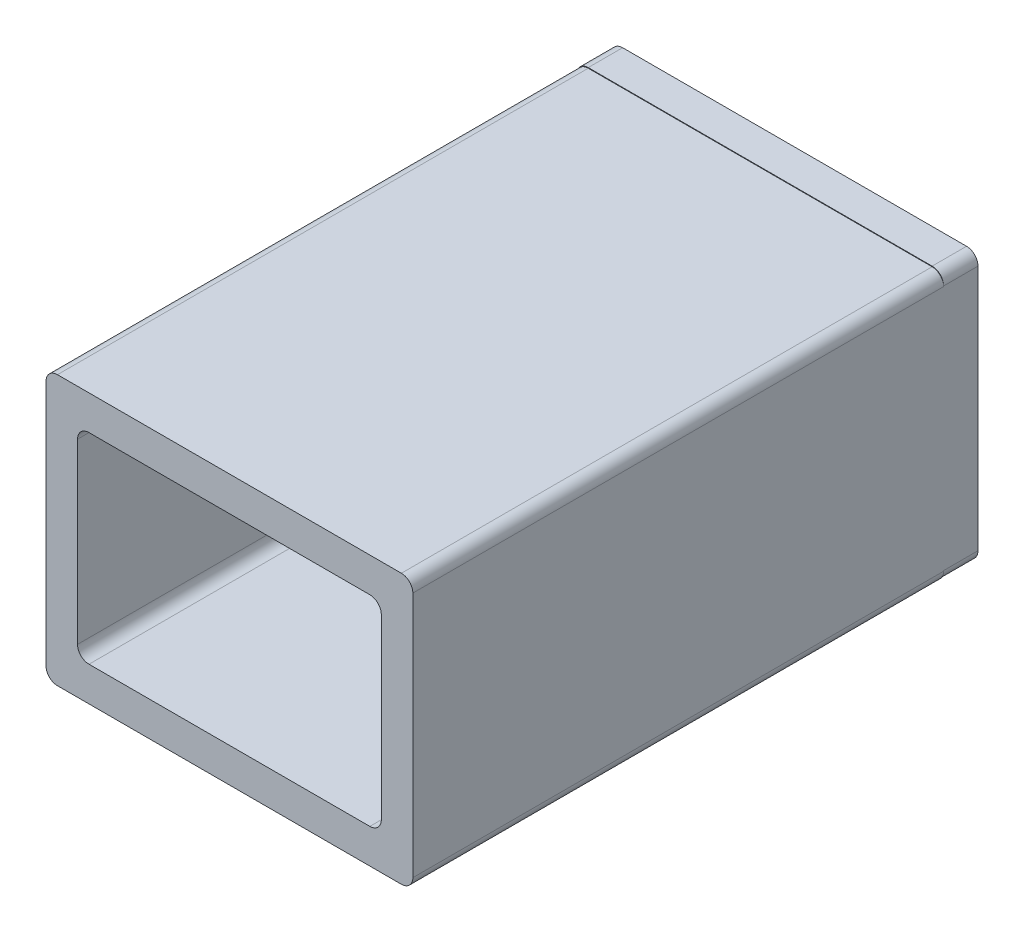
ISO-10303-21;
HEADER;
FILE_DESCRIPTION(('STEP AP214'),'2;1');
FILE_NAME('part.step','',(''),(''),'','','');
FILE_SCHEMA(('AUTOMOTIVE_DESIGN { 1 0 10303 214 1 1 1 1 }'));
ENDSEC;
DATA;
#1=APPLICATION_CONTEXT('core data for automotive mechanical design processes');
#2=APPLICATION_PROTOCOL_DEFINITION('international standard','automotive_design',2000,#1);
#3=PRODUCT_CONTEXT('',#1,'mechanical');
#4=PRODUCT('Part','Part','',(#3));
#5=PRODUCT_RELATED_PRODUCT_CATEGORY('part','',(#4));
#6=PRODUCT_DEFINITION_FORMATION('','',#4);
#7=PRODUCT_DEFINITION_CONTEXT('part definition',#1,'design');
#8=PRODUCT_DEFINITION('design','',#6,#7);
#9=PRODUCT_DEFINITION_SHAPE('','',#8);
#10=(LENGTH_UNIT() NAMED_UNIT(*) SI_UNIT(.MILLI.,.METRE.));
#11=(NAMED_UNIT(*) PLANE_ANGLE_UNIT() SI_UNIT($,.RADIAN.));
#12=(NAMED_UNIT(*) SI_UNIT($,.STERADIAN.) SOLID_ANGLE_UNIT());
#13=UNCERTAINTY_MEASURE_WITH_UNIT(LENGTH_MEASURE(1.E-05),#10,'distance_accuracy_value','');
#14=(GEOMETRIC_REPRESENTATION_CONTEXT(3) GLOBAL_UNCERTAINTY_ASSIGNED_CONTEXT((#13)) GLOBAL_UNIT_ASSIGNED_CONTEXT((#10,
#11,#12)) REPRESENTATION_CONTEXT('',''));
#15=CARTESIAN_POINT('',(0.,0.,0.));
#16=DIRECTION('',(0.,0.,1.));
#17=DIRECTION('',(1.,0.,0.));
#18=AXIS2_PLACEMENT_3D('',#15,#16,#17);
#19=CARTESIAN_POINT('',(15.,-10.75,46.3));
#20=DIRECTION('',(0.,0.,1.));
#21=DIRECTION('',(1.,0.,0.));
#22=AXIS2_PLACEMENT_3D('',#19,#20,#21);
#23=PLANE('',#22);
#24=CARTESIAN_POINT('',(15.,-10.75,46.3));
#25=DIRECTION('',(0.,0.,1.));
#26=DIRECTION('',(1.,0.,0.));
#27=AXIS2_PLACEMENT_3D('',#24,#25,#26);
#28=CIRCLE('',#27,0.999999999999999);
#29=CARTESIAN_POINT('',(15.,-11.75,46.3));
#30=VERTEX_POINT('',#29);
#31=CARTESIAN_POINT('',(16.,-10.75,46.3));
#32=VERTEX_POINT('',#31);
#33=EDGE_CURVE('E322',#30,#32,#28,.T.);
#34=ORIENTED_EDGE('',*,*,#33,.T.);
#35=DIRECTION('',(0.,1.,0.));
#36=VECTOR('',#35,1.);
#37=CARTESIAN_POINT('',(16.,10.75,46.3));
#38=LINE('',#37,#36);
#39=CARTESIAN_POINT('',(16.,10.75,46.3));
#40=VERTEX_POINT('',#39);
#41=EDGE_CURVE('E325',#32,#40,#38,.T.);
#42=ORIENTED_EDGE('',*,*,#41,.T.);
#43=CARTESIAN_POINT('',(15.,10.75,46.3));
#44=DIRECTION('',(0.,0.,1.));
#45=DIRECTION('',(-1.,0.,0.));
#46=AXIS2_PLACEMENT_3D('',#43,#44,#45);
#47=CIRCLE('',#46,1.);
#48=CARTESIAN_POINT('',(15.,11.75,46.3));
#49=VERTEX_POINT('',#48);
#50=EDGE_CURVE('E328',#40,#49,#47,.T.);
#51=ORIENTED_EDGE('',*,*,#50,.T.);
#52=DIRECTION('',(-1.,0.,0.));
#53=VECTOR('',#52,1.);
#54=CARTESIAN_POINT('',(-15.,11.75,46.3));
#55=LINE('',#54,#53);
#56=CARTESIAN_POINT('',(-15.,11.75,46.3));
#57=VERTEX_POINT('',#56);
#58=EDGE_CURVE('E330',#49,#57,#55,.T.);
#59=ORIENTED_EDGE('',*,*,#58,.T.);
#60=CARTESIAN_POINT('',(-15.,10.75,46.3));
#61=DIRECTION('',(0.,0.,1.));
#62=DIRECTION('',(1.,0.,0.));
#63=AXIS2_PLACEMENT_3D('',#60,#61,#62);
#64=CIRCLE('',#63,0.999999999999999);
#65=CARTESIAN_POINT('',(-16.,10.75,46.3));
#66=VERTEX_POINT('',#65);
#67=EDGE_CURVE('E332',#57,#66,#64,.T.);
#68=ORIENTED_EDGE('',*,*,#67,.T.);
#69=DIRECTION('',(0.,-1.,0.));
#70=VECTOR('',#69,1.);
#71=CARTESIAN_POINT('',(-16.,10.75,46.3));
#72=LINE('',#71,#70);
#73=CARTESIAN_POINT('',(-16.,-10.75,46.3));
#74=VERTEX_POINT('',#73);
#75=EDGE_CURVE('E334',#66,#74,#72,.T.);
#76=ORIENTED_EDGE('',*,*,#75,.T.);
#77=CARTESIAN_POINT('',(-15.,-10.75,46.3));
#78=DIRECTION('',(0.,0.,1.));
#79=DIRECTION('',(1.,0.,0.));
#80=AXIS2_PLACEMENT_3D('',#77,#78,#79);
#81=CIRCLE('',#80,1.);
#82=CARTESIAN_POINT('',(-15.,-11.75,46.3));
#83=VERTEX_POINT('',#82);
#84=EDGE_CURVE('E336',#74,#83,#81,.T.);
#85=ORIENTED_EDGE('',*,*,#84,.T.);
#86=DIRECTION('',(1.,0.,0.));
#87=VECTOR('',#86,1.);
#88=CARTESIAN_POINT('',(-15.,-11.75,46.3));
#89=LINE('',#88,#87);
#90=EDGE_CURVE('E338',#83,#30,#89,.T.);
#91=ORIENTED_EDGE('',*,*,#90,.T.);
#92=EDGE_LOOP('',(#34,#42,#51,#59,#68,#76,#85,#91));
#93=FACE_BOUND('',#92,.T.);
#94=DIRECTION('',(0.,-1.,0.));
#95=VECTOR('',#94,1.);
#96=CARTESIAN_POINT('',(-13.25,7.75,46.3));
#97=LINE('',#96,#95);
#98=CARTESIAN_POINT('',(-13.25,7.75,46.3));
#99=VERTEX_POINT('',#98);
#100=CARTESIAN_POINT('',(-13.25,-7.75,46.3));
#101=VERTEX_POINT('',#100);
#102=EDGE_CURVE('E268',#99,#101,#97,.T.);
#103=ORIENTED_EDGE('',*,*,#102,.F.);
#104=CARTESIAN_POINT('',(-12.25,7.75,46.3));
#105=DIRECTION('',(0.,0.,1.));
#106=DIRECTION('',(1.,0.,0.));
#107=AXIS2_PLACEMENT_3D('',#104,#105,#106);
#108=CIRCLE('',#107,1.);
#109=CARTESIAN_POINT('',(-12.25,8.75,46.3));
#110=VERTEX_POINT('',#109);
#111=EDGE_CURVE('E266',#110,#99,#108,.T.);
#112=ORIENTED_EDGE('',*,*,#111,.F.);
#113=DIRECTION('',(-1.,0.,0.));
#114=VECTOR('',#113,1.);
#115=CARTESIAN_POINT('',(-12.25,8.75,46.3));
#116=LINE('',#115,#114);
#117=CARTESIAN_POINT('',(12.25,8.75,46.3));
#118=VERTEX_POINT('',#117);
#119=EDGE_CURVE('E281',#118,#110,#116,.T.);
#120=ORIENTED_EDGE('',*,*,#119,.F.);
#121=CARTESIAN_POINT('',(12.25,7.75,46.3));
#122=DIRECTION('',(0.,0.,1.));
#123=DIRECTION('',(-1.,0.,0.));
#124=AXIS2_PLACEMENT_3D('',#121,#122,#123);
#125=CIRCLE('',#124,0.999999999999999);
#126=CARTESIAN_POINT('',(13.25,7.75,46.3));
#127=VERTEX_POINT('',#126);
#128=EDGE_CURVE('E279',#127,#118,#125,.T.);
#129=ORIENTED_EDGE('',*,*,#128,.F.);
#130=DIRECTION('',(0.,1.,0.));
#131=VECTOR('',#130,1.);
#132=CARTESIAN_POINT('',(13.25,7.75,46.3));
#133=LINE('',#132,#131);
#134=CARTESIAN_POINT('',(13.25,-7.75,46.3));
#135=VERTEX_POINT('',#134);
#136=EDGE_CURVE('E277',#135,#127,#133,.T.);
#137=ORIENTED_EDGE('',*,*,#136,.F.);
#138=CARTESIAN_POINT('',(12.25,-7.75,46.3));
#139=DIRECTION('',(0.,0.,1.));
#140=DIRECTION('',(1.,0.,0.));
#141=AXIS2_PLACEMENT_3D('',#138,#139,#140);
#142=CIRCLE('',#141,0.999999999999999);
#143=CARTESIAN_POINT('',(12.25,-8.75,46.3));
#144=VERTEX_POINT('',#143);
#145=EDGE_CURVE('E275',#144,#135,#142,.T.);
#146=ORIENTED_EDGE('',*,*,#145,.F.);
#147=DIRECTION('',(1.,0.,0.));
#148=VECTOR('',#147,1.);
#149=CARTESIAN_POINT('',(-12.25,-8.75,46.3));
#150=LINE('',#149,#148);
#151=CARTESIAN_POINT('',(-12.25,-8.75,46.3));
#152=VERTEX_POINT('',#151);
#153=EDGE_CURVE('E273',#152,#144,#150,.T.);
#154=ORIENTED_EDGE('',*,*,#153,.F.);
#155=CARTESIAN_POINT('',(-12.25,-7.75,46.3));
#156=DIRECTION('',(0.,0.,1.));
#157=DIRECTION('',(1.,0.,0.));
#158=AXIS2_PLACEMENT_3D('',#155,#156,#157);
#159=CIRCLE('',#158,1.);
#160=EDGE_CURVE('E271',#101,#152,#159,.T.);
#161=ORIENTED_EDGE('',*,*,#160,.F.);
#162=EDGE_LOOP('',(#103,#112,#120,#129,#137,#146,#154,#161));
#163=FACE_BOUND('',#162,.T.);
#164=ADVANCED_FACE('F33',(#93,#163),#23,.T.);
#165=CARTESIAN_POINT('',(15.,-10.75,0.));
#166=DIRECTION('',(0.,0.,1.));
#167=DIRECTION('',(1.,0.,0.));
#168=AXIS2_PLACEMENT_3D('',#165,#166,#167);
#169=PLANE('',#168);
#170=DIRECTION('',(1.,0.,0.));
#171=VECTOR('',#170,1.);
#172=CARTESIAN_POINT('',(-15.,-11.7,0.));
#173=LINE('',#172,#171);
#174=CARTESIAN_POINT('',(-15.,-11.7,0.));
#175=VERTEX_POINT('',#174);
#176=CARTESIAN_POINT('',(15.,-11.7,0.));
#177=VERTEX_POINT('',#176);
#178=EDGE_CURVE('E217',#175,#177,#173,.T.);
#179=ORIENTED_EDGE('',*,*,#178,.T.);
#180=CARTESIAN_POINT('',(15.,-10.7,0.));
#181=DIRECTION('',(0.,0.,1.));
#182=DIRECTION('',(1.,0.,0.));
#183=AXIS2_PLACEMENT_3D('',#180,#181,#182);
#184=CIRCLE('',#183,0.999999999999999);
#185=CARTESIAN_POINT('',(16.,-10.7,0.));
#186=VERTEX_POINT('',#185);
#187=EDGE_CURVE('E48',#177,#186,#184,.T.);
#188=ORIENTED_EDGE('',*,*,#187,.T.);
#189=DIRECTION('',(0.,1.,0.));
#190=VECTOR('',#189,1.);
#191=CARTESIAN_POINT('',(16.,10.75,0.));
#192=LINE('',#191,#190);
#193=CARTESIAN_POINT('',(16.,-10.75,0.));
#194=VERTEX_POINT('',#193);
#195=EDGE_CURVE('E199',#194,#186,#192,.T.);
#196=ORIENTED_EDGE('',*,*,#195,.F.);
#197=CARTESIAN_POINT('',(15.,-10.75,0.));
#198=DIRECTION('',(0.,0.,1.));
#199=DIRECTION('',(1.,0.,0.));
#200=AXIS2_PLACEMENT_3D('',#197,#198,#199);
#201=CIRCLE('',#200,0.999999999999999);
#202=CARTESIAN_POINT('',(15.,-11.75,0.));
#203=VERTEX_POINT('',#202);
#204=EDGE_CURVE('E321',#203,#194,#201,.T.);
#205=ORIENTED_EDGE('',*,*,#204,.F.);
#206=DIRECTION('',(1.,0.,0.));
#207=VECTOR('',#206,1.);
#208=CARTESIAN_POINT('',(-15.,-11.75,0.));
#209=LINE('',#208,#207);
#210=CARTESIAN_POINT('',(-15.,-11.75,0.));
#211=VERTEX_POINT('',#210);
#212=EDGE_CURVE('E326',#211,#203,#209,.T.);
#213=ORIENTED_EDGE('',*,*,#212,.F.);
#214=CARTESIAN_POINT('',(-15.,-10.75,0.));
#215=DIRECTION('',(0.,0.,1.));
#216=DIRECTION('',(1.,0.,0.));
#217=AXIS2_PLACEMENT_3D('',#214,#215,#216);
#218=CIRCLE('',#217,1.);
#219=CARTESIAN_POINT('',(-16.,-10.75,0.));
#220=VERTEX_POINT('',#219);
#221=EDGE_CURVE('E355',#220,#211,#218,.T.);
#222=ORIENTED_EDGE('',*,*,#221,.F.);
#223=DIRECTION('',(0.,-1.,0.));
#224=VECTOR('',#223,1.);
#225=CARTESIAN_POINT('',(-16.,10.75,0.));
#226=LINE('',#225,#224);
#227=CARTESIAN_POINT('',(-16.,-10.7,0.));
#228=VERTEX_POINT('',#227);
#229=EDGE_CURVE('E353',#228,#220,#226,.T.);
#230=ORIENTED_EDGE('',*,*,#229,.F.);
#231=CARTESIAN_POINT('',(-15.,-10.7,0.));
#232=DIRECTION('',(0.,0.,1.));
#233=DIRECTION('',(1.,0.,0.));
#234=AXIS2_PLACEMENT_3D('',#231,#232,#233);
#235=CIRCLE('',#234,0.999999999999999);
#236=EDGE_CURVE('E220',#228,#175,#235,.T.);
#237=ORIENTED_EDGE('',*,*,#236,.T.);
#238=EDGE_LOOP('',(#179,#188,#196,#205,#213,#222,#230,#237));
#239=FACE_BOUND('',#238,.T.);
#240=ADVANCED_FACE('F404',(#239),#169,.F.);
#241=CARTESIAN_POINT('',(15.,-10.75,46.3));
#242=DIRECTION('',(0.,0.,-1.));
#243=DIRECTION('',(-1.,0.,0.));
#244=AXIS2_PLACEMENT_3D('',#241,#242,#243);
#245=CYLINDRICAL_SURFACE('',#244,0.999999999999999);
#246=ORIENTED_EDGE('',*,*,#204,.T.);
#247=DIRECTION('',(0.,0.,-1.));
#248=VECTOR('',#247,1.);
#249=CARTESIAN_POINT('',(16.,-10.75,46.3));
#250=LINE('',#249,#248);
#251=EDGE_CURVE('E11',#32,#194,#250,.T.);
#252=ORIENTED_EDGE('',*,*,#251,.F.);
#253=ORIENTED_EDGE('',*,*,#33,.F.);
#254=DIRECTION('',(0.,0.,-1.));
#255=VECTOR('',#254,1.);
#256=CARTESIAN_POINT('',(15.,-11.75,46.3));
#257=LINE('',#256,#255);
#258=EDGE_CURVE('E340',#30,#203,#257,.T.);
#259=ORIENTED_EDGE('',*,*,#258,.T.);
#260=EDGE_LOOP('',(#246,#252,#253,#259));
#261=FACE_BOUND('',#260,.T.);
#262=ADVANCED_FACE('F35',(#261),#245,.T.);
#263=CARTESIAN_POINT('',(16.,10.75,46.3));
#264=DIRECTION('',(-1.,0.,0.));
#265=DIRECTION('',(0.,-1.,0.));
#266=AXIS2_PLACEMENT_3D('',#263,#264,#265);
#267=PLANE('',#266);
#268=ORIENTED_EDGE('',*,*,#195,.T.);
#269=DIRECTION('',(0.,0.,1.));
#270=VECTOR('',#269,1.);
#271=CARTESIAN_POINT('',(16.,-10.7,-3.));
#272=LINE('',#271,#270);
#273=CARTESIAN_POINT('',(16.,-10.7,-3.));
#274=VERTEX_POINT('',#273);
#275=EDGE_CURVE('E194',#274,#186,#272,.T.);
#276=ORIENTED_EDGE('',*,*,#275,.F.);
#277=DIRECTION('',(0.,1.,0.));
#278=VECTOR('',#277,1.);
#279=CARTESIAN_POINT('',(16.,10.8,-3.));
#280=LINE('',#279,#278);
#281=CARTESIAN_POINT('',(16.,10.8,-3.));
#282=VERTEX_POINT('',#281);
#283=EDGE_CURVE('E198',#274,#282,#280,.T.);
#284=ORIENTED_EDGE('',*,*,#283,.T.);
#285=DIRECTION('',(0.,0.,1.));
#286=VECTOR('',#285,1.);
#287=CARTESIAN_POINT('',(16.,10.8,-3.));
#288=LINE('',#287,#286);
#289=CARTESIAN_POINT('',(16.,10.8,0.));
#290=VERTEX_POINT('',#289);
#291=EDGE_CURVE('E201',#282,#290,#288,.T.);
#292=ORIENTED_EDGE('',*,*,#291,.T.);
#293=DIRECTION('',(0.,1.,0.));
#294=VECTOR('',#293,1.);
#295=CARTESIAN_POINT('',(16.,10.8,0.));
#296=LINE('',#295,#294);
#297=CARTESIAN_POINT('',(16.,10.75,0.));
#298=VERTEX_POINT('',#297);
#299=EDGE_CURVE('E238',#298,#290,#296,.T.);
#300=ORIENTED_EDGE('',*,*,#299,.F.);
#301=DIRECTION('',(0.,0.,-1.));
#302=VECTOR('',#301,1.);
#303=CARTESIAN_POINT('',(16.,10.75,46.3));
#304=LINE('',#303,#302);
#305=EDGE_CURVE('E41',#40,#298,#304,.T.);
#306=ORIENTED_EDGE('',*,*,#305,.F.);
#307=ORIENTED_EDGE('',*,*,#41,.F.);
#308=ORIENTED_EDGE('',*,*,#251,.T.);
#309=EDGE_LOOP('',(#268,#276,#284,#292,#300,#306,#307,#308));
#310=FACE_BOUND('',#309,.T.);
#311=ADVANCED_FACE('F196',(#310),#267,.F.);
#312=CARTESIAN_POINT('',(15.,10.75,46.3));
#313=DIRECTION('',(0.,0.,-1.));
#314=DIRECTION('',(-1.,0.,0.));
#315=AXIS2_PLACEMENT_3D('',#312,#313,#314);
#316=CYLINDRICAL_SURFACE('',#315,1.);
#317=CARTESIAN_POINT('',(15.,10.75,0.));
#318=DIRECTION('',(0.,0.,1.));
#319=DIRECTION('',(-1.,0.,0.));
#320=AXIS2_PLACEMENT_3D('',#317,#318,#319);
#321=CIRCLE('',#320,1.);
#322=CARTESIAN_POINT('',(15.,11.75,0.));
#323=VERTEX_POINT('',#322);
#324=EDGE_CURVE('E344',#298,#323,#321,.T.);
#325=ORIENTED_EDGE('',*,*,#324,.T.);
#326=DIRECTION('',(0.,0.,-1.));
#327=VECTOR('',#326,1.);
#328=CARTESIAN_POINT('',(15.,11.75,46.3));
#329=LINE('',#328,#327);
#330=EDGE_CURVE('E372',#49,#323,#329,.T.);
#331=ORIENTED_EDGE('',*,*,#330,.F.);
#332=ORIENTED_EDGE('',*,*,#50,.F.);
#333=ORIENTED_EDGE('',*,*,#305,.T.);
#334=EDGE_LOOP('',(#325,#331,#332,#333));
#335=FACE_BOUND('',#334,.T.);
#336=ADVANCED_FACE('F378',(#335),#316,.T.);
#337=CARTESIAN_POINT('',(-15.,11.75,46.3));
#338=DIRECTION('',(0.,-1.,0.));
#339=DIRECTION('',(0.,0.,-1.));
#340=AXIS2_PLACEMENT_3D('',#337,#338,#339);
#341=PLANE('',#340);
#342=DIRECTION('',(-1.,0.,0.));
#343=VECTOR('',#342,1.);
#344=CARTESIAN_POINT('',(-15.,11.75,0.));
#345=LINE('',#344,#343);
#346=CARTESIAN_POINT('',(-15.,11.75,0.));
#347=VERTEX_POINT('',#346);
#348=EDGE_CURVE('E347',#323,#347,#345,.T.);
#349=ORIENTED_EDGE('',*,*,#348,.T.);
#350=DIRECTION('',(0.,0.,-1.));
#351=VECTOR('',#350,1.);
#352=CARTESIAN_POINT('',(-15.,11.75,46.3));
#353=LINE('',#352,#351);
#354=EDGE_CURVE('E369',#57,#347,#353,.T.);
#355=ORIENTED_EDGE('',*,*,#354,.F.);
#356=ORIENTED_EDGE('',*,*,#58,.F.);
#357=ORIENTED_EDGE('',*,*,#330,.T.);
#358=EDGE_LOOP('',(#349,#355,#356,#357));
#359=FACE_BOUND('',#358,.T.);
#360=ADVANCED_FACE('F386',(#359),#341,.F.);
#361=CARTESIAN_POINT('',(-15.,10.75,46.3));
#362=DIRECTION('',(0.,0.,-1.));
#363=DIRECTION('',(-1.,0.,0.));
#364=AXIS2_PLACEMENT_3D('',#361,#362,#363);
#365=CYLINDRICAL_SURFACE('',#364,0.999999999999999);
#366=CARTESIAN_POINT('',(-15.,10.75,0.));
#367=DIRECTION('',(0.,0.,1.));
#368=DIRECTION('',(1.,0.,0.));
#369=AXIS2_PLACEMENT_3D('',#366,#367,#368);
#370=CIRCLE('',#369,0.999999999999999);
#371=CARTESIAN_POINT('',(-16.,10.75,0.));
#372=VERTEX_POINT('',#371);
#373=EDGE_CURVE('E350',#347,#372,#370,.T.);
#374=ORIENTED_EDGE('',*,*,#373,.T.);
#375=DIRECTION('',(0.,0.,-1.));
#376=VECTOR('',#375,1.);
#377=CARTESIAN_POINT('',(-16.,10.75,46.3));
#378=LINE('',#377,#376);
#379=EDGE_CURVE('E366',#66,#372,#378,.T.);
#380=ORIENTED_EDGE('',*,*,#379,.F.);
#381=ORIENTED_EDGE('',*,*,#67,.F.);
#382=ORIENTED_EDGE('',*,*,#354,.T.);
#383=EDGE_LOOP('',(#374,#380,#381,#382));
#384=FACE_BOUND('',#383,.T.);
#385=ADVANCED_FACE('F390',(#384),#365,.T.);
#386=CARTESIAN_POINT('',(-16.,10.75,46.3));
#387=DIRECTION('',(1.,0.,0.));
#388=DIRECTION('',(0.,0.,-1.));
#389=AXIS2_PLACEMENT_3D('',#386,#387,#388);
#390=PLANE('',#389);
#391=ORIENTED_EDGE('',*,*,#379,.T.);
#392=DIRECTION('',(0.,-1.,0.));
#393=VECTOR('',#392,1.);
#394=CARTESIAN_POINT('',(-16.,10.8,0.));
#395=LINE('',#394,#393);
#396=CARTESIAN_POINT('',(-16.,10.8,0.));
#397=VERTEX_POINT('',#396);
#398=EDGE_CURVE('E249',#397,#372,#395,.T.);
#399=ORIENTED_EDGE('',*,*,#398,.F.);
#400=DIRECTION('',(0.,0.,1.));
#401=VECTOR('',#400,1.);
#402=CARTESIAN_POINT('',(-16.,10.8,-3.));
#403=LINE('',#402,#401);
#404=CARTESIAN_POINT('',(-16.,10.8,-3.));
#405=VERTEX_POINT('',#404);
#406=EDGE_CURVE('E259',#405,#397,#403,.T.);
#407=ORIENTED_EDGE('',*,*,#406,.F.);
#408=DIRECTION('',(0.,-1.,0.));
#409=VECTOR('',#408,1.);
#410=CARTESIAN_POINT('',(-16.,10.8,-3.));
#411=LINE('',#410,#409);
#412=CARTESIAN_POINT('',(-16.,-10.7,-3.));
#413=VERTEX_POINT('',#412);
#414=EDGE_CURVE('E230',#405,#413,#411,.T.);
#415=ORIENTED_EDGE('',*,*,#414,.T.);
#416=DIRECTION('',(0.,0.,1.));
#417=VECTOR('',#416,1.);
#418=CARTESIAN_POINT('',(-16.,-10.7,-3.));
#419=LINE('',#418,#417);
#420=EDGE_CURVE('E257',#413,#228,#419,.T.);
#421=ORIENTED_EDGE('',*,*,#420,.T.);
#422=ORIENTED_EDGE('',*,*,#229,.T.);
#423=DIRECTION('',(0.,0.,-1.));
#424=VECTOR('',#423,1.);
#425=CARTESIAN_POINT('',(-16.,-10.75,46.3));
#426=LINE('',#425,#424);
#427=EDGE_CURVE('E363',#74,#220,#426,.T.);
#428=ORIENTED_EDGE('',*,*,#427,.F.);
#429=ORIENTED_EDGE('',*,*,#75,.F.);
#430=EDGE_LOOP('',(#391,#399,#407,#415,#421,#422,#428,#429));
#431=FACE_BOUND('',#430,.T.);
#432=ADVANCED_FACE('F416',(#431),#390,.F.);
#433=CARTESIAN_POINT('',(-15.,-10.75,46.3));
#434=DIRECTION('',(0.,0.,-1.));
#435=DIRECTION('',(-1.,0.,0.));
#436=AXIS2_PLACEMENT_3D('',#433,#434,#435);
#437=CYLINDRICAL_SURFACE('',#436,1.);
#438=ORIENTED_EDGE('',*,*,#221,.T.);
#439=DIRECTION('',(0.,0.,-1.));
#440=VECTOR('',#439,1.);
#441=CARTESIAN_POINT('',(-15.,-11.75,46.3));
#442=LINE('',#441,#440);
#443=EDGE_CURVE('E360',#83,#211,#442,.T.);
#444=ORIENTED_EDGE('',*,*,#443,.F.);
#445=ORIENTED_EDGE('',*,*,#84,.F.);
#446=ORIENTED_EDGE('',*,*,#427,.T.);
#447=EDGE_LOOP('',(#438,#444,#445,#446));
#448=FACE_BOUND('',#447,.T.);
#449=ADVANCED_FACE('F449',(#448),#437,.T.);
#450=CARTESIAN_POINT('',(-15.,-11.75,46.3));
#451=DIRECTION('',(0.,1.,0.));
#452=DIRECTION('',(0.,0.,1.));
#453=AXIS2_PLACEMENT_3D('',#450,#451,#452);
#454=PLANE('',#453);
#455=ORIENTED_EDGE('',*,*,#212,.T.);
#456=ORIENTED_EDGE('',*,*,#258,.F.);
#457=ORIENTED_EDGE('',*,*,#90,.F.);
#458=ORIENTED_EDGE('',*,*,#443,.T.);
#459=EDGE_LOOP('',(#455,#456,#457,#458));
#460=FACE_BOUND('',#459,.T.);
#461=ADVANCED_FACE('F446',(#460),#454,.F.);
#462=CARTESIAN_POINT('',(-12.25,7.75,46.3));
#463=DIRECTION('',(0.,0.,-1.));
#464=DIRECTION('',(-1.,0.,0.));
#465=AXIS2_PLACEMENT_3D('',#462,#463,#464);
#466=CYLINDRICAL_SURFACE('',#465,1.);
#467=CARTESIAN_POINT('',(-12.25,7.75,0.));
#468=DIRECTION('',(0.,0.,1.));
#469=DIRECTION('',(1.,0.,0.));
#470=AXIS2_PLACEMENT_3D('',#467,#468,#469);
#471=CIRCLE('',#470,1.);
#472=CARTESIAN_POINT('',(-12.25,8.75,0.));
#473=VERTEX_POINT('',#472);
#474=CARTESIAN_POINT('',(-13.25,7.75,0.));
#475=VERTEX_POINT('',#474);
#476=EDGE_CURVE('E254',#473,#475,#471,.T.);
#477=ORIENTED_EDGE('',*,*,#476,.F.);
#478=DIRECTION('',(0.,0.,-1.));
#479=VECTOR('',#478,1.);
#480=CARTESIAN_POINT('',(-12.25,8.75,46.3));
#481=LINE('',#480,#479);
#482=EDGE_CURVE('E283',#110,#473,#481,.T.);
#483=ORIENTED_EDGE('',*,*,#482,.F.);
#484=ORIENTED_EDGE('',*,*,#111,.T.);
#485=DIRECTION('',(0.,0.,-1.));
#486=VECTOR('',#485,1.);
#487=CARTESIAN_POINT('',(-13.25,7.75,46.3));
#488=LINE('',#487,#486);
#489=EDGE_CURVE('E318',#99,#475,#488,.T.);
#490=ORIENTED_EDGE('',*,*,#489,.T.);
#491=EDGE_LOOP('',(#477,#483,#484,#490));
#492=FACE_BOUND('',#491,.T.);
#493=ADVANCED_FACE('F443',(#492),#466,.F.);
#494=CARTESIAN_POINT('',(-13.25,7.75,46.3));
#495=DIRECTION('',(1.,0.,0.));
#496=DIRECTION('',(0.,1.,0.));
#497=AXIS2_PLACEMENT_3D('',#494,#495,#496);
#498=PLANE('',#497);
#499=DIRECTION('',(0.,-1.,0.));
#500=VECTOR('',#499,1.);
#501=CARTESIAN_POINT('',(-13.25,7.75,0.));
#502=LINE('',#501,#500);
#503=CARTESIAN_POINT('',(-13.25,-7.75,0.));
#504=VERTEX_POINT('',#503);
#505=EDGE_CURVE('E286',#475,#504,#502,.T.);
#506=ORIENTED_EDGE('',*,*,#505,.F.);
#507=ORIENTED_EDGE('',*,*,#489,.F.);
#508=ORIENTED_EDGE('',*,*,#102,.T.);
#509=DIRECTION('',(0.,0.,-1.));
#510=VECTOR('',#509,1.);
#511=CARTESIAN_POINT('',(-13.25,-7.75,46.3));
#512=LINE('',#511,#510);
#513=EDGE_CURVE('E316',#101,#504,#512,.T.);
#514=ORIENTED_EDGE('',*,*,#513,.T.);
#515=EDGE_LOOP('',(#506,#507,#508,#514));
#516=FACE_BOUND('',#515,.T.);
#517=ADVANCED_FACE('F517',(#516),#498,.T.);
#518=CARTESIAN_POINT('',(-12.25,-7.75,46.3));
#519=DIRECTION('',(0.,0.,-1.));
#520=DIRECTION('',(-1.,0.,0.));
#521=AXIS2_PLACEMENT_3D('',#518,#519,#520);
#522=CYLINDRICAL_SURFACE('',#521,1.);
#523=CARTESIAN_POINT('',(-12.25,-7.75,0.));
#524=DIRECTION('',(0.,0.,1.));
#525=DIRECTION('',(1.,0.,0.));
#526=AXIS2_PLACEMENT_3D('',#523,#524,#525);
#527=CIRCLE('',#526,1.);
#528=CARTESIAN_POINT('',(-12.25,-8.75,0.));
#529=VERTEX_POINT('',#528);
#530=EDGE_CURVE('E289',#504,#529,#527,.T.);
#531=ORIENTED_EDGE('',*,*,#530,.F.);
#532=ORIENTED_EDGE('',*,*,#513,.F.);
#533=ORIENTED_EDGE('',*,*,#160,.T.);
#534=DIRECTION('',(0.,0.,-1.));
#535=VECTOR('',#534,1.);
#536=CARTESIAN_POINT('',(-12.25,-8.75,46.3));
#537=LINE('',#536,#535);
#538=EDGE_CURVE('E314',#152,#529,#537,.T.);
#539=ORIENTED_EDGE('',*,*,#538,.T.);
#540=EDGE_LOOP('',(#531,#532,#533,#539));
#541=FACE_BOUND('',#540,.T.);
#542=ADVANCED_FACE('F526',(#541),#522,.F.);
#543=CARTESIAN_POINT('',(-12.25,-8.75,46.3));
#544=DIRECTION('',(0.,1.,0.));
#545=DIRECTION('',(0.,0.,1.));
#546=AXIS2_PLACEMENT_3D('',#543,#544,#545);
#547=PLANE('',#546);
#548=DIRECTION('',(1.,0.,0.));
#549=VECTOR('',#548,1.);
#550=CARTESIAN_POINT('',(-12.25,-8.75,0.));
#551=LINE('',#550,#549);
#552=CARTESIAN_POINT('',(12.25,-8.75,0.));
#553=VERTEX_POINT('',#552);
#554=EDGE_CURVE('E292',#529,#553,#551,.T.);
#555=ORIENTED_EDGE('',*,*,#554,.F.);
#556=ORIENTED_EDGE('',*,*,#538,.F.);
#557=ORIENTED_EDGE('',*,*,#153,.T.);
#558=DIRECTION('',(0.,0.,-1.));
#559=VECTOR('',#558,1.);
#560=CARTESIAN_POINT('',(12.25,-8.75,46.3));
#561=LINE('',#560,#559);
#562=EDGE_CURVE('E312',#144,#553,#561,.T.);
#563=ORIENTED_EDGE('',*,*,#562,.T.);
#564=EDGE_LOOP('',(#555,#556,#557,#563));
#565=FACE_BOUND('',#564,.T.);
#566=ADVANCED_FACE('F535',(#565),#547,.T.);
#567=CARTESIAN_POINT('',(12.25,-7.75,46.3));
#568=DIRECTION('',(0.,0.,-1.));
#569=DIRECTION('',(-1.,0.,0.));
#570=AXIS2_PLACEMENT_3D('',#567,#568,#569);
#571=CYLINDRICAL_SURFACE('',#570,0.999999999999999);
#572=CARTESIAN_POINT('',(12.25,-7.75,0.));
#573=DIRECTION('',(0.,0.,1.));
#574=DIRECTION('',(1.,0.,0.));
#575=AXIS2_PLACEMENT_3D('',#572,#573,#574);
#576=CIRCLE('',#575,0.999999999999999);
#577=CARTESIAN_POINT('',(13.25,-7.75,0.));
#578=VERTEX_POINT('',#577);
#579=EDGE_CURVE('E295',#553,#578,#576,.T.);
#580=ORIENTED_EDGE('',*,*,#579,.F.);
#581=ORIENTED_EDGE('',*,*,#562,.F.);
#582=ORIENTED_EDGE('',*,*,#145,.T.);
#583=DIRECTION('',(0.,0.,-1.));
#584=VECTOR('',#583,1.);
#585=CARTESIAN_POINT('',(13.25,-7.75,46.3));
#586=LINE('',#585,#584);
#587=EDGE_CURVE('E310',#135,#578,#586,.T.);
#588=ORIENTED_EDGE('',*,*,#587,.T.);
#589=EDGE_LOOP('',(#580,#581,#582,#588));
#590=FACE_BOUND('',#589,.T.);
#591=ADVANCED_FACE('F545',(#590),#571,.F.);
#592=CARTESIAN_POINT('',(13.25,7.75,46.3));
#593=DIRECTION('',(-1.,0.,0.));
#594=DIRECTION('',(0.,0.,1.));
#595=AXIS2_PLACEMENT_3D('',#592,#593,#594);
#596=PLANE('',#595);
#597=DIRECTION('',(0.,1.,0.));
#598=VECTOR('',#597,1.);
#599=CARTESIAN_POINT('',(13.25,7.75,0.));
#600=LINE('',#599,#598);
#601=CARTESIAN_POINT('',(13.25,7.75,0.));
#602=VERTEX_POINT('',#601);
#603=EDGE_CURVE('E298',#578,#602,#600,.T.);
#604=ORIENTED_EDGE('',*,*,#603,.F.);
#605=ORIENTED_EDGE('',*,*,#587,.F.);
#606=ORIENTED_EDGE('',*,*,#136,.T.);
#607=DIRECTION('',(0.,0.,-1.));
#608=VECTOR('',#607,1.);
#609=CARTESIAN_POINT('',(13.25,7.75,46.3));
#610=LINE('',#609,#608);
#611=EDGE_CURVE('E308',#127,#602,#610,.T.);
#612=ORIENTED_EDGE('',*,*,#611,.T.);
#613=EDGE_LOOP('',(#604,#605,#606,#612));
#614=FACE_BOUND('',#613,.T.);
#615=ADVANCED_FACE('F555',(#614),#596,.T.);
#616=CARTESIAN_POINT('',(12.25,7.75,46.3));
#617=DIRECTION('',(0.,0.,-1.));
#618=DIRECTION('',(-1.,0.,0.));
#619=AXIS2_PLACEMENT_3D('',#616,#617,#618);
#620=CYLINDRICAL_SURFACE('',#619,0.999999999999999);
#621=CARTESIAN_POINT('',(12.25,7.75,0.));
#622=DIRECTION('',(0.,0.,1.));
#623=DIRECTION('',(-1.,0.,0.));
#624=AXIS2_PLACEMENT_3D('',#621,#622,#623);
#625=CIRCLE('',#624,0.999999999999999);
#626=CARTESIAN_POINT('',(12.25,8.75,0.));
#627=VERTEX_POINT('',#626);
#628=EDGE_CURVE('E301',#602,#627,#625,.T.);
#629=ORIENTED_EDGE('',*,*,#628,.F.);
#630=ORIENTED_EDGE('',*,*,#611,.F.);
#631=ORIENTED_EDGE('',*,*,#128,.T.);
#632=DIRECTION('',(0.,0.,-1.));
#633=VECTOR('',#632,1.);
#634=CARTESIAN_POINT('',(12.25,8.75,46.3));
#635=LINE('',#634,#633);
#636=EDGE_CURVE('E56',#118,#627,#635,.T.);
#637=ORIENTED_EDGE('',*,*,#636,.T.);
#638=EDGE_LOOP('',(#629,#630,#631,#637));
#639=FACE_BOUND('',#638,.T.);
#640=ADVANCED_FACE('F565',(#639),#620,.F.);
#641=CARTESIAN_POINT('',(-12.25,8.75,46.3));
#642=DIRECTION('',(0.,-1.,0.));
#643=DIRECTION('',(0.,0.,-1.));
#644=AXIS2_PLACEMENT_3D('',#641,#642,#643);
#645=PLANE('',#644);
#646=DIRECTION('',(-1.,0.,0.));
#647=VECTOR('',#646,1.);
#648=CARTESIAN_POINT('',(-12.25,8.75,0.));
#649=LINE('',#648,#647);
#650=EDGE_CURVE('E269',#627,#473,#649,.T.);
#651=ORIENTED_EDGE('',*,*,#650,.F.);
#652=ORIENTED_EDGE('',*,*,#636,.F.);
#653=ORIENTED_EDGE('',*,*,#119,.T.);
#654=ORIENTED_EDGE('',*,*,#482,.T.);
#655=EDGE_LOOP('',(#651,#652,#653,#654));
#656=FACE_BOUND('',#655,.T.);
#657=ADVANCED_FACE('F433',(#656),#645,.T.);
#658=CARTESIAN_POINT('',(15.,-10.7,-3.));
#659=DIRECTION('',(0.,0.,1.));
#660=DIRECTION('',(1.,0.,0.));
#661=AXIS2_PLACEMENT_3D('',#658,#659,#660);
#662=PLANE('',#661);
#663=CARTESIAN_POINT('',(15.,-10.7,-3.));
#664=DIRECTION('',(0.,0.,1.));
#665=DIRECTION('',(1.,0.,0.));
#666=AXIS2_PLACEMENT_3D('',#663,#664,#665);
#667=CIRCLE('',#666,0.999999999999999);
#668=CARTESIAN_POINT('',(15.,-11.7,-3.));
#669=VERTEX_POINT('',#668);
#670=EDGE_CURVE('E209',#669,#274,#667,.T.);
#671=ORIENTED_EDGE('',*,*,#670,.F.);
#672=DIRECTION('',(1.,0.,0.));
#673=VECTOR('',#672,1.);
#674=CARTESIAN_POINT('',(-15.,-11.7,-3.));
#675=LINE('',#674,#673);
#676=CARTESIAN_POINT('',(-15.,-11.7,-3.));
#677=VERTEX_POINT('',#676);
#678=EDGE_CURVE('E202',#677,#669,#675,.T.);
#679=ORIENTED_EDGE('',*,*,#678,.F.);
#680=CARTESIAN_POINT('',(-15.,-10.7,-3.));
#681=DIRECTION('',(0.,0.,1.));
#682=DIRECTION('',(1.,0.,0.));
#683=AXIS2_PLACEMENT_3D('',#680,#681,#682);
#684=CIRCLE('',#683,0.999999999999999);
#685=EDGE_CURVE('E233',#413,#677,#684,.T.);
#686=ORIENTED_EDGE('',*,*,#685,.F.);
#687=ORIENTED_EDGE('',*,*,#414,.F.);
#688=CARTESIAN_POINT('',(-15.,10.8,-3.));
#689=DIRECTION('',(0.,0.,1.));
#690=DIRECTION('',(1.,0.,0.));
#691=AXIS2_PLACEMENT_3D('',#688,#689,#690);
#692=CIRCLE('',#691,1.);
#693=CARTESIAN_POINT('',(-15.,11.8,-3.));
#694=VERTEX_POINT('',#693);
#695=EDGE_CURVE('E227',#694,#405,#692,.T.);
#696=ORIENTED_EDGE('',*,*,#695,.F.);
#697=DIRECTION('',(-1.,0.,0.));
#698=VECTOR('',#697,1.);
#699=CARTESIAN_POINT('',(-15.,11.8,-3.));
#700=LINE('',#699,#698);
#701=CARTESIAN_POINT('',(15.,11.8,-3.));
#702=VERTEX_POINT('',#701);
#703=EDGE_CURVE('E224',#702,#694,#700,.T.);
#704=ORIENTED_EDGE('',*,*,#703,.F.);
#705=CARTESIAN_POINT('',(15.,10.8,-3.));
#706=DIRECTION('',(0.,0.,1.));
#707=DIRECTION('',(-1.,0.,0.));
#708=AXIS2_PLACEMENT_3D('',#705,#706,#707);
#709=CIRCLE('',#708,1.);
#710=EDGE_CURVE('E213',#282,#702,#709,.T.);
#711=ORIENTED_EDGE('',*,*,#710,.F.);
#712=ORIENTED_EDGE('',*,*,#283,.F.);
#713=EDGE_LOOP('',(#671,#679,#686,#687,#696,#704,#711,#712));
#714=FACE_BOUND('',#713,.T.);
#715=ADVANCED_FACE('F207',(#714),#662,.F.);
#716=CARTESIAN_POINT('',(15.,10.8,-3.));
#717=DIRECTION('',(0.,0.,1.));
#718=DIRECTION('',(1.,0.,0.));
#719=AXIS2_PLACEMENT_3D('',#716,#717,#718);
#720=CYLINDRICAL_SURFACE('',#719,1.);
#721=CARTESIAN_POINT('',(15.,10.8,0.));
#722=DIRECTION('',(0.,0.,1.));
#723=DIRECTION('',(-1.,0.,0.));
#724=AXIS2_PLACEMENT_3D('',#721,#722,#723);
#725=CIRCLE('',#724,1.);
#726=CARTESIAN_POINT('',(15.,11.8,0.));
#727=VERTEX_POINT('',#726);
#728=EDGE_CURVE('E240',#290,#727,#725,.T.);
#729=ORIENTED_EDGE('',*,*,#728,.F.);
#730=ORIENTED_EDGE('',*,*,#291,.F.);
#731=ORIENTED_EDGE('',*,*,#710,.T.);
#732=DIRECTION('',(0.,0.,1.));
#733=VECTOR('',#732,1.);
#734=CARTESIAN_POINT('',(15.,11.8,-3.));
#735=LINE('',#734,#733);
#736=EDGE_CURVE('E263',#702,#727,#735,.T.);
#737=ORIENTED_EDGE('',*,*,#736,.T.);
#738=EDGE_LOOP('',(#729,#730,#731,#737));
#739=FACE_BOUND('',#738,.T.);
#740=ADVANCED_FACE('F425',(#739),#720,.T.);
#741=CARTESIAN_POINT('',(-15.,11.8,-3.));
#742=DIRECTION('',(0.,1.,0.));
#743=DIRECTION('',(0.,0.,1.));
#744=AXIS2_PLACEMENT_3D('',#741,#742,#743);
#745=PLANE('',#744);
#746=DIRECTION('',(-1.,0.,0.));
#747=VECTOR('',#746,1.);
#748=CARTESIAN_POINT('',(-15.,11.8,0.));
#749=LINE('',#748,#747);
#750=CARTESIAN_POINT('',(-15.,11.8,0.));
#751=VERTEX_POINT('',#750);
#752=EDGE_CURVE('E243',#727,#751,#749,.T.);
#753=ORIENTED_EDGE('',*,*,#752,.F.);
#754=ORIENTED_EDGE('',*,*,#736,.F.);
#755=ORIENTED_EDGE('',*,*,#703,.T.);
#756=DIRECTION('',(0.,0.,1.));
#757=VECTOR('',#756,1.);
#758=CARTESIAN_POINT('',(-15.,11.8,-3.));
#759=LINE('',#758,#757);
#760=EDGE_CURVE('E261',#694,#751,#759,.T.);
#761=ORIENTED_EDGE('',*,*,#760,.T.);
#762=EDGE_LOOP('',(#753,#754,#755,#761));
#763=FACE_BOUND('',#762,.T.);
#764=ADVANCED_FACE('F423',(#763),#745,.T.);
#765=CARTESIAN_POINT('',(-15.,10.8,-3.));
#766=DIRECTION('',(0.,0.,1.));
#767=DIRECTION('',(1.,0.,0.));
#768=AXIS2_PLACEMENT_3D('',#765,#766,#767);
#769=CYLINDRICAL_SURFACE('',#768,1.);
#770=CARTESIAN_POINT('',(-15.,10.8,0.));
#771=DIRECTION('',(0.,0.,1.));
#772=DIRECTION('',(1.,0.,0.));
#773=AXIS2_PLACEMENT_3D('',#770,#771,#772);
#774=CIRCLE('',#773,1.);
#775=EDGE_CURVE('E246',#751,#397,#774,.T.);
#776=ORIENTED_EDGE('',*,*,#775,.F.);
#777=ORIENTED_EDGE('',*,*,#760,.F.);
#778=ORIENTED_EDGE('',*,*,#695,.T.);
#779=ORIENTED_EDGE('',*,*,#406,.T.);
#780=EDGE_LOOP('',(#776,#777,#778,#779));
#781=FACE_BOUND('',#780,.T.);
#782=ADVANCED_FACE('F420',(#781),#769,.T.);
#783=CARTESIAN_POINT('',(-15.,-10.7,-3.));
#784=DIRECTION('',(0.,0.,1.));
#785=DIRECTION('',(1.,0.,0.));
#786=AXIS2_PLACEMENT_3D('',#783,#784,#785);
#787=CYLINDRICAL_SURFACE('',#786,0.999999999999999);
#788=ORIENTED_EDGE('',*,*,#236,.F.);
#789=ORIENTED_EDGE('',*,*,#420,.F.);
#790=ORIENTED_EDGE('',*,*,#685,.T.);
#791=DIRECTION('',(0.,0.,1.));
#792=VECTOR('',#791,1.);
#793=CARTESIAN_POINT('',(-15.,-11.7,-3.));
#794=LINE('',#793,#792);
#795=EDGE_CURVE('E255',#677,#175,#794,.T.);
#796=ORIENTED_EDGE('',*,*,#795,.T.);
#797=EDGE_LOOP('',(#788,#789,#790,#796));
#798=FACE_BOUND('',#797,.T.);
#799=ADVANCED_FACE('F606',(#798),#787,.T.);
#800=CARTESIAN_POINT('',(-15.,-11.7,-3.));
#801=DIRECTION('',(0.,-1.,0.));
#802=DIRECTION('',(0.,0.,-1.));
#803=AXIS2_PLACEMENT_3D('',#800,#801,#802);
#804=PLANE('',#803);
#805=ORIENTED_EDGE('',*,*,#178,.F.);
#806=ORIENTED_EDGE('',*,*,#795,.F.);
#807=ORIENTED_EDGE('',*,*,#678,.T.);
#808=DIRECTION('',(0.,0.,1.));
#809=VECTOR('',#808,1.);
#810=CARTESIAN_POINT('',(15.,-11.7,-3.));
#811=LINE('',#810,#809);
#812=EDGE_CURVE('E216',#669,#177,#811,.T.);
#813=ORIENTED_EDGE('',*,*,#812,.T.);
#814=EDGE_LOOP('',(#805,#806,#807,#813));
#815=FACE_BOUND('',#814,.T.);
#816=ADVANCED_FACE('F410',(#815),#804,.T.);
#817=CARTESIAN_POINT('',(15.,-10.7,-3.));
#818=DIRECTION('',(0.,0.,1.));
#819=DIRECTION('',(1.,0.,0.));
#820=AXIS2_PLACEMENT_3D('',#817,#818,#819);
#821=CYLINDRICAL_SURFACE('',#820,0.999999999999999);
#822=ORIENTED_EDGE('',*,*,#187,.F.);
#823=ORIENTED_EDGE('',*,*,#812,.F.);
#824=ORIENTED_EDGE('',*,*,#670,.T.);
#825=ORIENTED_EDGE('',*,*,#275,.T.);
#826=EDGE_LOOP('',(#822,#823,#824,#825));
#827=FACE_BOUND('',#826,.T.);
#828=ADVANCED_FACE('F215',(#827),#821,.T.);
#829=CARTESIAN_POINT('',(15.,-10.7,0.));
#830=DIRECTION('',(0.,0.,1.));
#831=DIRECTION('',(1.,0.,0.));
#832=AXIS2_PLACEMENT_3D('',#829,#830,#831);
#833=PLANE('',#832);
#834=ORIENTED_EDGE('',*,*,#373,.F.);
#835=ORIENTED_EDGE('',*,*,#348,.F.);
#836=ORIENTED_EDGE('',*,*,#324,.F.);
#837=ORIENTED_EDGE('',*,*,#299,.T.);
#838=ORIENTED_EDGE('',*,*,#728,.T.);
#839=ORIENTED_EDGE('',*,*,#752,.T.);
#840=ORIENTED_EDGE('',*,*,#775,.T.);
#841=ORIENTED_EDGE('',*,*,#398,.T.);
#842=EDGE_LOOP('',(#834,#835,#836,#837,#838,#839,#840,#841));
#843=FACE_BOUND('',#842,.T.);
#844=ADVANCED_FACE('F383',(#843),#833,.T.);
#845=ORIENTED_EDGE('',*,*,#650,.T.);
#846=ORIENTED_EDGE('',*,*,#476,.T.);
#847=ORIENTED_EDGE('',*,*,#505,.T.);
#848=ORIENTED_EDGE('',*,*,#530,.T.);
#849=ORIENTED_EDGE('',*,*,#554,.T.);
#850=ORIENTED_EDGE('',*,*,#579,.T.);
#851=ORIENTED_EDGE('',*,*,#603,.T.);
#852=ORIENTED_EDGE('',*,*,#628,.T.);
#853=EDGE_LOOP('',(#845,#846,#847,#848,#849,#850,#851,#852));
#854=FACE_BOUND('',#853,.T.);
#855=ADVANCED_FACE('F638',(#854),#833,.T.);
#856=CLOSED_SHELL('',(#164,#240,#262,#311,#336,#360,#385,#432,#449,#461,#493,#517,#542,#566,
#591,#615,#640,#657,#715,#740,#764,#782,#799,#816,#828,#844,#855));
#857=MANIFOLD_SOLID_BREP('B2',#856);
#858=ADVANCED_BREP_SHAPE_REPRESENTATION('',(#18,#857),#14);
#859=SHAPE_DEFINITION_REPRESENTATION(#9,#858);
ENDSEC;
END-ISO-10303-21;
